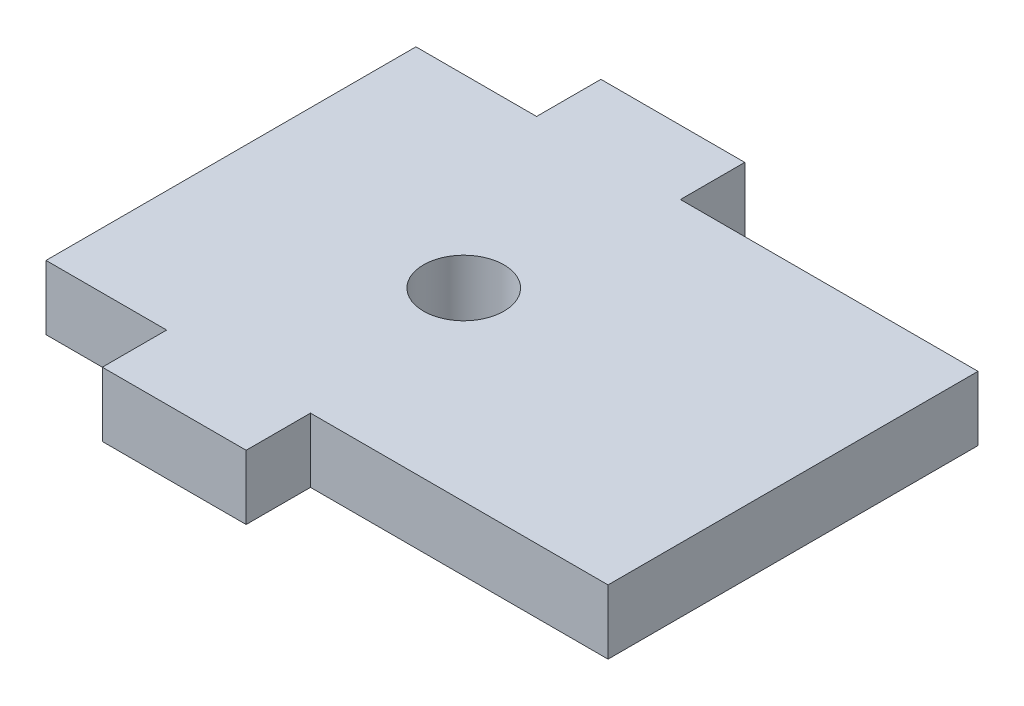
ISO-10303-21;
HEADER;
FILE_DESCRIPTION(('STEP AP214'),'2;1');
FILE_NAME('part.step','',(''),(''),'','','');
FILE_SCHEMA(('AUTOMOTIVE_DESIGN { 1 0 10303 214 1 1 1 1 }'));
ENDSEC;
DATA;
#1=APPLICATION_CONTEXT('core data for automotive mechanical design processes');
#2=APPLICATION_PROTOCOL_DEFINITION('international standard','automotive_design',2000,#1);
#3=PRODUCT_CONTEXT('',#1,'mechanical');
#4=PRODUCT('Part','Part','',(#3));
#5=PRODUCT_RELATED_PRODUCT_CATEGORY('part','',(#4));
#6=PRODUCT_DEFINITION_FORMATION('','',#4);
#7=PRODUCT_DEFINITION_CONTEXT('part definition',#1,'design');
#8=PRODUCT_DEFINITION('design','',#6,#7);
#9=PRODUCT_DEFINITION_SHAPE('','',#8);
#10=(LENGTH_UNIT() NAMED_UNIT(*) SI_UNIT(.MILLI.,.METRE.));
#11=(NAMED_UNIT(*) PLANE_ANGLE_UNIT() SI_UNIT($,.RADIAN.));
#12=(NAMED_UNIT(*) SI_UNIT($,.STERADIAN.) SOLID_ANGLE_UNIT());
#13=UNCERTAINTY_MEASURE_WITH_UNIT(LENGTH_MEASURE(1.E-05),#10,'distance_accuracy_value','');
#14=(GEOMETRIC_REPRESENTATION_CONTEXT(3) GLOBAL_UNCERTAINTY_ASSIGNED_CONTEXT((#13)) GLOBAL_UNIT_ASSIGNED_CONTEXT((#10,
#11,#12)) REPRESENTATION_CONTEXT('',''));
#15=CARTESIAN_POINT('',(0.,0.,0.));
#16=DIRECTION('',(0.,0.,1.));
#17=DIRECTION('',(1.,0.,0.));
#18=AXIS2_PLACEMENT_3D('',#15,#16,#17);
#19=CARTESIAN_POINT('',(0.,5.08,-14.605));
#20=DIRECTION('',(0.,0.,1.));
#21=DIRECTION('',(1.,0.,0.));
#22=AXIS2_PLACEMENT_3D('',#19,#20,#21);
#23=PLANE('',#22);
#24=DIRECTION('',(-1.,0.,0.));
#25=VECTOR('',#24,1.);
#26=CARTESIAN_POINT('',(0.,0.,-14.605));
#27=LINE('',#26,#25);
#28=CARTESIAN_POINT('',(29.1744399242496,0.,-14.605));
#29=VERTEX_POINT('',#28);
#30=CARTESIAN_POINT('',(5.67943992424959,0.,-14.605));
#31=VERTEX_POINT('',#30);
#32=EDGE_CURVE('E148',#29,#31,#27,.T.);
#33=ORIENTED_EDGE('',*,*,#32,.T.);
#34=DIRECTION('',(0.,-1.,0.));
#35=VECTOR('',#34,1.);
#36=CARTESIAN_POINT('',(5.67943992424959,5.08,-14.605));
#37=LINE('',#36,#35);
#38=CARTESIAN_POINT('',(5.67943992424959,5.08,-14.605));
#39=VERTEX_POINT('',#38);
#40=EDGE_CURVE('E11',#39,#31,#37,.T.);
#41=ORIENTED_EDGE('',*,*,#40,.F.);
#42=DIRECTION('',(-1.,0.,0.));
#43=VECTOR('',#42,1.);
#44=CARTESIAN_POINT('',(0.,5.08,-14.605));
#45=LINE('',#44,#43);
#46=CARTESIAN_POINT('',(29.1744399242496,5.08,-14.605));
#47=VERTEX_POINT('',#46);
#48=EDGE_CURVE('E208',#47,#39,#45,.T.);
#49=ORIENTED_EDGE('',*,*,#48,.F.);
#50=DIRECTION('',(0.,1.,0.));
#51=VECTOR('',#50,1.);
#52=CARTESIAN_POINT('',(29.1744399242496,-32.3787739113142,-14.605));
#53=LINE('',#52,#51);
#54=EDGE_CURVE('E236',#29,#47,#53,.T.);
#55=ORIENTED_EDGE('',*,*,#54,.F.);
#56=EDGE_LOOP('',(#33,#41,#49,#55));
#57=FACE_BOUND('',#56,.T.);
#58=ADVANCED_FACE('F35',(#57),#23,.F.);
#59=CARTESIAN_POINT('',(5.67943992424959,5.08,0.));
#60=DIRECTION('',(-1.,0.,0.));
#61=DIRECTION('',(0.,0.,1.));
#62=AXIS2_PLACEMENT_3D('',#59,#60,#61);
#63=PLANE('',#62);
#64=DIRECTION('',(0.,0.,-1.));
#65=VECTOR('',#64,1.);
#66=CARTESIAN_POINT('',(5.67943992424959,0.,0.));
#67=LINE('',#66,#65);
#68=CARTESIAN_POINT('',(5.67943992424959,0.,-19.685));
#69=VERTEX_POINT('',#68);
#70=EDGE_CURVE('E151',#31,#69,#67,.T.);
#71=ORIENTED_EDGE('',*,*,#70,.T.);
#72=DIRECTION('',(0.,-1.,0.));
#73=VECTOR('',#72,1.);
#74=CARTESIAN_POINT('',(5.67943992424959,5.08,-19.685));
#75=LINE('',#74,#73);
#76=CARTESIAN_POINT('',(5.67943992424959,5.08,-19.685));
#77=VERTEX_POINT('',#76);
#78=EDGE_CURVE('E44',#77,#69,#75,.T.);
#79=ORIENTED_EDGE('',*,*,#78,.F.);
#80=DIRECTION('',(0.,0.,-1.));
#81=VECTOR('',#80,1.);
#82=CARTESIAN_POINT('',(5.67943992424959,5.08,0.));
#83=LINE('',#82,#81);
#84=EDGE_CURVE('E98',#39,#77,#83,.T.);
#85=ORIENTED_EDGE('',*,*,#84,.F.);
#86=ORIENTED_EDGE('',*,*,#40,.T.);
#87=EDGE_LOOP('',(#71,#79,#85,#86));
#88=FACE_BOUND('',#87,.T.);
#89=ADVANCED_FACE('F37',(#88),#63,.F.);
#90=CARTESIAN_POINT('',(0.,5.08,-19.685));
#91=DIRECTION('',(0.,0.,-1.));
#92=DIRECTION('',(-1.,0.,0.));
#93=AXIS2_PLACEMENT_3D('',#90,#91,#92);
#94=PLANE('',#93);
#95=DIRECTION('',(1.,0.,0.));
#96=VECTOR('',#95,1.);
#97=CARTESIAN_POINT('',(0.,0.,-19.685));
#98=LINE('',#97,#96);
#99=CARTESIAN_POINT('',(-5.67943992424959,0.,-19.685));
#100=VERTEX_POINT('',#99);
#101=EDGE_CURVE('E156',#100,#69,#98,.T.);
#102=ORIENTED_EDGE('',*,*,#101,.F.);
#103=DIRECTION('',(0.,-1.,0.));
#104=VECTOR('',#103,1.);
#105=CARTESIAN_POINT('',(-5.67943992424959,5.08,-19.685));
#106=LINE('',#105,#104);
#107=CARTESIAN_POINT('',(-5.67943992424959,5.08,-19.685));
#108=VERTEX_POINT('',#107);
#109=EDGE_CURVE('E185',#108,#100,#106,.T.);
#110=ORIENTED_EDGE('',*,*,#109,.F.);
#111=DIRECTION('',(1.,0.,0.));
#112=VECTOR('',#111,1.);
#113=CARTESIAN_POINT('',(0.,5.08,-19.685));
#114=LINE('',#113,#112);
#115=EDGE_CURVE('E191',#108,#77,#114,.T.);
#116=ORIENTED_EDGE('',*,*,#115,.T.);
#117=ORIENTED_EDGE('',*,*,#78,.T.);
#118=EDGE_LOOP('',(#102,#110,#116,#117));
#119=FACE_BOUND('',#118,.T.);
#120=ADVANCED_FACE('F189',(#119),#94,.T.);
#121=CARTESIAN_POINT('',(-5.67943992424959,5.08,0.));
#122=DIRECTION('',(-1.,0.,0.));
#123=DIRECTION('',(0.,0.,1.));
#124=AXIS2_PLACEMENT_3D('',#121,#122,#123);
#125=PLANE('',#124);
#126=DIRECTION('',(0.,0.,-1.));
#127=VECTOR('',#126,1.);
#128=CARTESIAN_POINT('',(-5.67943992424959,0.,0.));
#129=LINE('',#128,#127);
#130=CARTESIAN_POINT('',(-5.67943992424959,0.,-14.605));
#131=VERTEX_POINT('',#130);
#132=EDGE_CURVE('E159',#131,#100,#129,.T.);
#133=ORIENTED_EDGE('',*,*,#132,.F.);
#134=DIRECTION('',(0.,-1.,0.));
#135=VECTOR('',#134,1.);
#136=CARTESIAN_POINT('',(-5.67943992424959,5.08,-14.605));
#137=LINE('',#136,#135);
#138=CARTESIAN_POINT('',(-5.67943992424959,5.08,-14.605));
#139=VERTEX_POINT('',#138);
#140=EDGE_CURVE('E183',#139,#131,#137,.T.);
#141=ORIENTED_EDGE('',*,*,#140,.F.);
#142=DIRECTION('',(0.,0.,-1.));
#143=VECTOR('',#142,1.);
#144=CARTESIAN_POINT('',(-5.67943992424959,5.08,0.));
#145=LINE('',#144,#143);
#146=EDGE_CURVE('E204',#139,#108,#145,.T.);
#147=ORIENTED_EDGE('',*,*,#146,.T.);
#148=ORIENTED_EDGE('',*,*,#109,.T.);
#149=EDGE_LOOP('',(#133,#141,#147,#148));
#150=FACE_BOUND('',#149,.T.);
#151=ADVANCED_FACE('F200',(#150),#125,.T.);
#152=CARTESIAN_POINT('',(-15.2044399242496,0.,-14.605));
#153=VERTEX_POINT('',#152);
#154=EDGE_CURVE('E153',#131,#153,#27,.T.);
#155=ORIENTED_EDGE('',*,*,#154,.T.);
#156=DIRECTION('',(0.,-1.,0.));
#157=VECTOR('',#156,1.);
#158=CARTESIAN_POINT('',(-15.2044399242496,5.08,-14.605));
#159=LINE('',#158,#157);
#160=CARTESIAN_POINT('',(-15.2044399242496,5.08,-14.605));
#161=VERTEX_POINT('',#160);
#162=EDGE_CURVE('E180',#161,#153,#159,.T.);
#163=ORIENTED_EDGE('',*,*,#162,.F.);
#164=EDGE_CURVE('E206',#139,#161,#45,.T.);
#165=ORIENTED_EDGE('',*,*,#164,.F.);
#166=ORIENTED_EDGE('',*,*,#140,.T.);
#167=EDGE_LOOP('',(#155,#163,#165,#166));
#168=FACE_BOUND('',#167,.T.);
#169=ADVANCED_FACE('F250',(#168),#23,.F.);
#170=CARTESIAN_POINT('',(-15.2044399242496,5.08,0.));
#171=DIRECTION('',(1.,0.,0.));
#172=DIRECTION('',(0.,0.,-1.));
#173=AXIS2_PLACEMENT_3D('',#170,#171,#172);
#174=PLANE('',#173);
#175=DIRECTION('',(0.,0.,1.));
#176=VECTOR('',#175,1.);
#177=CARTESIAN_POINT('',(-15.2044399242496,0.,0.));
#178=LINE('',#177,#176);
#179=CARTESIAN_POINT('',(-15.2044399242496,0.,14.605));
#180=VERTEX_POINT('',#179);
#181=EDGE_CURVE('E162',#153,#180,#178,.T.);
#182=ORIENTED_EDGE('',*,*,#181,.T.);
#183=DIRECTION('',(0.,-1.,0.));
#184=VECTOR('',#183,1.);
#185=CARTESIAN_POINT('',(-15.2044399242496,5.08,14.605));
#186=LINE('',#185,#184);
#187=CARTESIAN_POINT('',(-15.2044399242496,5.08,14.605));
#188=VERTEX_POINT('',#187);
#189=EDGE_CURVE('E178',#188,#180,#186,.T.);
#190=ORIENTED_EDGE('',*,*,#189,.F.);
#191=DIRECTION('',(0.,0.,1.));
#192=VECTOR('',#191,1.);
#193=CARTESIAN_POINT('',(-15.2044399242496,5.08,0.));
#194=LINE('',#193,#192);
#195=EDGE_CURVE('E212',#161,#188,#194,.T.);
#196=ORIENTED_EDGE('',*,*,#195,.F.);
#197=ORIENTED_EDGE('',*,*,#162,.T.);
#198=EDGE_LOOP('',(#182,#190,#196,#197));
#199=FACE_BOUND('',#198,.T.);
#200=ADVANCED_FACE('F252',(#199),#174,.F.);
#201=CARTESIAN_POINT('',(0.,5.08,14.605));
#202=DIRECTION('',(0.,0.,1.));
#203=DIRECTION('',(1.,0.,0.));
#204=AXIS2_PLACEMENT_3D('',#201,#202,#203);
#205=PLANE('',#204);
#206=DIRECTION('',(-1.,0.,0.));
#207=VECTOR('',#206,1.);
#208=CARTESIAN_POINT('',(0.,0.,14.605));
#209=LINE('',#208,#207);
#210=CARTESIAN_POINT('',(-5.67943992424959,0.,14.605));
#211=VERTEX_POINT('',#210);
#212=EDGE_CURVE('E165',#211,#180,#209,.T.);
#213=ORIENTED_EDGE('',*,*,#212,.F.);
#214=DIRECTION('',(0.,-1.,0.));
#215=VECTOR('',#214,1.);
#216=CARTESIAN_POINT('',(-5.67943992424959,5.08,14.605));
#217=LINE('',#216,#215);
#218=CARTESIAN_POINT('',(-5.67943992424959,5.08,14.605));
#219=VERTEX_POINT('',#218);
#220=EDGE_CURVE('E139',#219,#211,#217,.T.);
#221=ORIENTED_EDGE('',*,*,#220,.F.);
#222=DIRECTION('',(-1.,0.,0.));
#223=VECTOR('',#222,1.);
#224=CARTESIAN_POINT('',(0.,5.08,14.605));
#225=LINE('',#224,#223);
#226=EDGE_CURVE('E129',#219,#188,#225,.T.);
#227=ORIENTED_EDGE('',*,*,#226,.T.);
#228=ORIENTED_EDGE('',*,*,#189,.T.);
#229=EDGE_LOOP('',(#213,#221,#227,#228));
#230=FACE_BOUND('',#229,.T.);
#231=ADVANCED_FACE('F254',(#230),#205,.T.);
#232=CARTESIAN_POINT('',(-5.67943992424959,5.08,0.));
#233=DIRECTION('',(1.,0.,0.));
#234=DIRECTION('',(0.,0.,-1.));
#235=AXIS2_PLACEMENT_3D('',#232,#233,#234);
#236=PLANE('',#235);
#237=DIRECTION('',(0.,0.,1.));
#238=VECTOR('',#237,1.);
#239=CARTESIAN_POINT('',(-5.67943992424959,0.,0.));
#240=LINE('',#239,#238);
#241=CARTESIAN_POINT('',(-5.67943992424958,0.,19.685));
#242=VERTEX_POINT('',#241);
#243=EDGE_CURVE('E136',#211,#242,#240,.T.);
#244=ORIENTED_EDGE('',*,*,#243,.T.);
#245=DIRECTION('',(0.,-1.,0.));
#246=VECTOR('',#245,1.);
#247=CARTESIAN_POINT('',(-5.67943992424958,5.08,19.685));
#248=LINE('',#247,#246);
#249=CARTESIAN_POINT('',(-5.67943992424958,5.08,19.685));
#250=VERTEX_POINT('',#249);
#251=EDGE_CURVE('E133',#250,#242,#248,.T.);
#252=ORIENTED_EDGE('',*,*,#251,.F.);
#253=DIRECTION('',(0.,0.,1.));
#254=VECTOR('',#253,1.);
#255=CARTESIAN_POINT('',(-5.67943992424959,5.08,0.));
#256=LINE('',#255,#254);
#257=EDGE_CURVE('E123',#219,#250,#256,.T.);
#258=ORIENTED_EDGE('',*,*,#257,.F.);
#259=ORIENTED_EDGE('',*,*,#220,.T.);
#260=EDGE_LOOP('',(#244,#252,#258,#259));
#261=FACE_BOUND('',#260,.T.);
#262=ADVANCED_FACE('F134',(#261),#236,.F.);
#263=CARTESIAN_POINT('',(0.,5.08,19.685));
#264=DIRECTION('',(0.,0.,-1.));
#265=DIRECTION('',(-1.,0.,0.));
#266=AXIS2_PLACEMENT_3D('',#263,#264,#265);
#267=PLANE('',#266);
#268=DIRECTION('',(1.,0.,0.));
#269=VECTOR('',#268,1.);
#270=CARTESIAN_POINT('',(0.,0.,19.685));
#271=LINE('',#270,#269);
#272=CARTESIAN_POINT('',(5.67943992424958,0.,19.685));
#273=VERTEX_POINT('',#272);
#274=EDGE_CURVE('E170',#242,#273,#271,.T.);
#275=ORIENTED_EDGE('',*,*,#274,.T.);
#276=DIRECTION('',(0.,-1.,0.));
#277=VECTOR('',#276,1.);
#278=CARTESIAN_POINT('',(5.67943992424958,5.08,19.685));
#279=LINE('',#278,#277);
#280=CARTESIAN_POINT('',(5.67943992424958,5.08,19.685));
#281=VERTEX_POINT('',#280);
#282=EDGE_CURVE('E86',#281,#273,#279,.T.);
#283=ORIENTED_EDGE('',*,*,#282,.F.);
#284=DIRECTION('',(1.,0.,0.));
#285=VECTOR('',#284,1.);
#286=CARTESIAN_POINT('',(0.,5.08,19.685));
#287=LINE('',#286,#285);
#288=EDGE_CURVE('E127',#250,#281,#287,.T.);
#289=ORIENTED_EDGE('',*,*,#288,.F.);
#290=ORIENTED_EDGE('',*,*,#251,.T.);
#291=EDGE_LOOP('',(#275,#283,#289,#290));
#292=FACE_BOUND('',#291,.T.);
#293=ADVANCED_FACE('F141',(#292),#267,.F.);
#294=CARTESIAN_POINT('',(5.67943992424959,5.08,0.));
#295=DIRECTION('',(1.,0.,0.));
#296=DIRECTION('',(0.,0.,-1.));
#297=AXIS2_PLACEMENT_3D('',#294,#295,#296);
#298=PLANE('',#297);
#299=DIRECTION('',(0.,0.,1.));
#300=VECTOR('',#299,1.);
#301=CARTESIAN_POINT('',(5.67943992424959,0.,0.));
#302=LINE('',#301,#300);
#303=CARTESIAN_POINT('',(5.67943992424959,0.,14.605));
#304=VERTEX_POINT('',#303);
#305=EDGE_CURVE('E172',#304,#273,#302,.T.);
#306=ORIENTED_EDGE('',*,*,#305,.F.);
#307=DIRECTION('',(0.,-1.,0.));
#308=VECTOR('',#307,1.);
#309=CARTESIAN_POINT('',(5.67943992424959,5.08,14.605));
#310=LINE('',#309,#308);
#311=CARTESIAN_POINT('',(5.67943992424959,5.08,14.605));
#312=VERTEX_POINT('',#311);
#313=EDGE_CURVE('E52',#312,#304,#310,.T.);
#314=ORIENTED_EDGE('',*,*,#313,.F.);
#315=DIRECTION('',(0.,0.,1.));
#316=VECTOR('',#315,1.);
#317=CARTESIAN_POINT('',(5.67943992424959,5.08,0.));
#318=LINE('',#317,#316);
#319=EDGE_CURVE('E142',#312,#281,#318,.T.);
#320=ORIENTED_EDGE('',*,*,#319,.T.);
#321=ORIENTED_EDGE('',*,*,#282,.T.);
#322=EDGE_LOOP('',(#306,#314,#320,#321));
#323=FACE_BOUND('',#322,.T.);
#324=ADVANCED_FACE('F255',(#323),#298,.T.);
#325=CARTESIAN_POINT('',(29.1744399242496,0.,14.605));
#326=VERTEX_POINT('',#325);
#327=EDGE_CURVE('E168',#326,#304,#209,.T.);
#328=ORIENTED_EDGE('',*,*,#327,.F.);
#329=DIRECTION('',(0.,1.,0.));
#330=VECTOR('',#329,1.);
#331=CARTESIAN_POINT('',(29.1744399242496,-32.3787739113142,14.605));
#332=LINE('',#331,#330);
#333=CARTESIAN_POINT('',(29.1744399242496,5.08,14.605));
#334=VERTEX_POINT('',#333);
#335=EDGE_CURVE('E219',#326,#334,#332,.T.);
#336=ORIENTED_EDGE('',*,*,#335,.T.);
#337=EDGE_CURVE('E144',#334,#312,#225,.T.);
#338=ORIENTED_EDGE('',*,*,#337,.T.);
#339=ORIENTED_EDGE('',*,*,#313,.T.);
#340=EDGE_LOOP('',(#328,#336,#338,#339));
#341=FACE_BOUND('',#340,.T.);
#342=ADVANCED_FACE('F216',(#341),#205,.T.);
#343=CARTESIAN_POINT('',(0.,5.08,0.));
#344=DIRECTION('',(0.,1.,0.));
#345=DIRECTION('',(0.,0.,1.));
#346=AXIS2_PLACEMENT_3D('',#343,#344,#345);
#347=PLANE('',#346);
#348=CARTESIAN_POINT('',(3.175,5.08,0.));
#349=DIRECTION('',(0.,1.,0.));
#350=DIRECTION('',(0.,0.,1.));
#351=AXIS2_PLACEMENT_3D('',#348,#349,#350);
#352=CIRCLE('',#351,3.17499999999999);
#353=CARTESIAN_POINT('',(3.175,5.08,3.17499999999999));
#354=VERTEX_POINT('',#353);
#355=EDGE_CURVE('E237',#354,#354,#352,.T.);
#356=ORIENTED_EDGE('',*,*,#355,.F.);
#357=EDGE_LOOP('',(#356));
#358=FACE_BOUND('',#357,.T.);
#359=ORIENTED_EDGE('',*,*,#48,.T.);
#360=ORIENTED_EDGE('',*,*,#84,.T.);
#361=ORIENTED_EDGE('',*,*,#115,.F.);
#362=ORIENTED_EDGE('',*,*,#146,.F.);
#363=ORIENTED_EDGE('',*,*,#164,.T.);
#364=ORIENTED_EDGE('',*,*,#195,.T.);
#365=ORIENTED_EDGE('',*,*,#226,.F.);
#366=ORIENTED_EDGE('',*,*,#257,.T.);
#367=ORIENTED_EDGE('',*,*,#288,.T.);
#368=ORIENTED_EDGE('',*,*,#319,.F.);
#369=ORIENTED_EDGE('',*,*,#337,.F.);
#370=DIRECTION('',(0.,0.,-1.));
#371=VECTOR('',#370,1.);
#372=CARTESIAN_POINT('',(29.1744399242496,5.08,-14.605));
#373=LINE('',#372,#371);
#374=EDGE_CURVE('E223',#334,#47,#373,.T.);
#375=ORIENTED_EDGE('',*,*,#374,.T.);
#376=EDGE_LOOP('',(#359,#360,#361,#362,#363,#364,#365,#366,#367,#368,#369,#375));
#377=FACE_BOUND('',#376,.T.);
#378=ADVANCED_FACE('F125',(#358,#377),#347,.T.);
#379=CARTESIAN_POINT('',(0.,0.,0.));
#380=DIRECTION('',(0.,1.,0.));
#381=DIRECTION('',(0.,0.,1.));
#382=AXIS2_PLACEMENT_3D('',#379,#380,#381);
#383=PLANE('',#382);
#384=CARTESIAN_POINT('',(3.175,0.,0.));
#385=DIRECTION('',(0.,1.,0.));
#386=DIRECTION('',(0.,0.,1.));
#387=AXIS2_PLACEMENT_3D('',#384,#385,#386);
#388=CIRCLE('',#387,3.175);
#389=CARTESIAN_POINT('',(3.175,0.,3.175));
#390=VERTEX_POINT('',#389);
#391=EDGE_CURVE('E152',#390,#390,#388,.T.);
#392=ORIENTED_EDGE('',*,*,#391,.T.);
#393=EDGE_LOOP('',(#392));
#394=FACE_BOUND('',#393,.T.);
#395=ORIENTED_EDGE('',*,*,#32,.F.);
#396=DIRECTION('',(0.,0.,1.));
#397=VECTOR('',#396,1.);
#398=CARTESIAN_POINT('',(29.1744399242496,0.,-14.605));
#399=LINE('',#398,#397);
#400=EDGE_CURVE('E230',#29,#326,#399,.T.);
#401=ORIENTED_EDGE('',*,*,#400,.T.);
#402=ORIENTED_EDGE('',*,*,#327,.T.);
#403=ORIENTED_EDGE('',*,*,#305,.T.);
#404=ORIENTED_EDGE('',*,*,#274,.F.);
#405=ORIENTED_EDGE('',*,*,#243,.F.);
#406=ORIENTED_EDGE('',*,*,#212,.T.);
#407=ORIENTED_EDGE('',*,*,#181,.F.);
#408=ORIENTED_EDGE('',*,*,#154,.F.);
#409=ORIENTED_EDGE('',*,*,#132,.T.);
#410=ORIENTED_EDGE('',*,*,#101,.T.);
#411=ORIENTED_EDGE('',*,*,#70,.F.);
#412=EDGE_LOOP('',(#395,#401,#402,#403,#404,#405,#406,#407,#408,#409,#410,#411));
#413=FACE_BOUND('',#412,.T.);
#414=ADVANCED_FACE('F195',(#394,#413),#383,.F.);
#415=CARTESIAN_POINT('',(3.175,5.08,0.));
#416=DIRECTION('',(0.,1.,0.));
#417=DIRECTION('',(0.,0.,1.));
#418=AXIS2_PLACEMENT_3D('',#415,#416,#417);
#419=CYLINDRICAL_SURFACE('',#418,3.17499999999999);
#420=ORIENTED_EDGE('',*,*,#391,.F.);
#421=EDGE_LOOP('',(#420));
#422=FACE_BOUND('',#421,.T.);
#423=ORIENTED_EDGE('',*,*,#355,.T.);
#424=EDGE_LOOP('',(#423));
#425=FACE_BOUND('',#424,.T.);
#426=ADVANCED_FACE('F370',(#422,#425),#419,.F.);
#427=CARTESIAN_POINT('',(29.1744399242496,-32.3787739113142,-14.605));
#428=DIRECTION('',(1.,0.,0.));
#429=DIRECTION('',(0.,0.,-1.));
#430=AXIS2_PLACEMENT_3D('',#427,#428,#429);
#431=PLANE('',#430);
#432=ORIENTED_EDGE('',*,*,#400,.F.);
#433=ORIENTED_EDGE('',*,*,#54,.T.);
#434=ORIENTED_EDGE('',*,*,#374,.F.);
#435=ORIENTED_EDGE('',*,*,#335,.F.);
#436=EDGE_LOOP('',(#432,#433,#434,#435));
#437=FACE_BOUND('',#436,.T.);
#438=ADVANCED_FACE('F235',(#437),#431,.T.);
#439=CLOSED_SHELL('',(#58,#89,#120,#151,#169,#200,#231,#262,#293,#324,#342,#378,#414,#426,#438));
#440=MANIFOLD_SOLID_BREP('B2',#439);
#441=ADVANCED_BREP_SHAPE_REPRESENTATION('',(#18,#440),#14);
#442=SHAPE_DEFINITION_REPRESENTATION(#9,#441);
ENDSEC;
END-ISO-10303-21;
